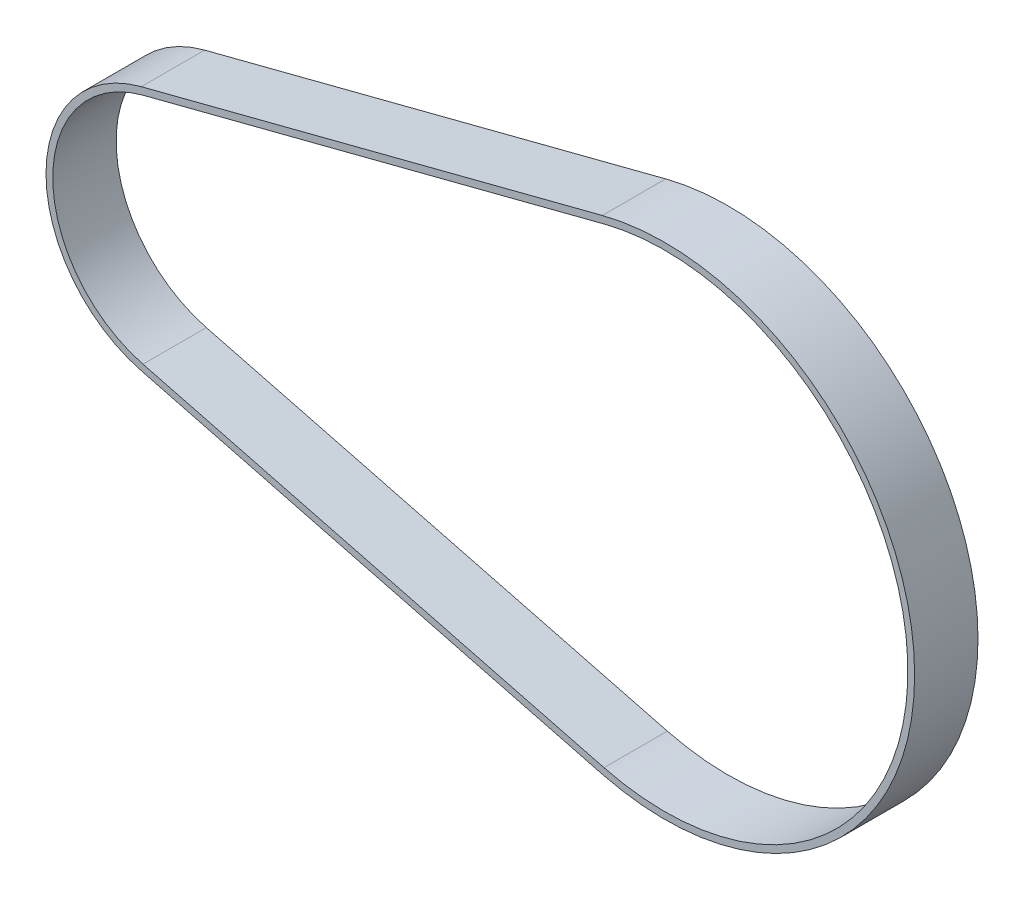
ISO-10303-21;
HEADER;
FILE_DESCRIPTION(('STEP AP214'),'2;1');
FILE_NAME('part.step','',(''),(''),'','','');
FILE_SCHEMA(('AUTOMOTIVE_DESIGN { 1 0 10303 214 1 1 1 1 }'));
ENDSEC;
DATA;
#1=APPLICATION_CONTEXT('core data for automotive mechanical design processes');
#2=APPLICATION_PROTOCOL_DEFINITION('international standard','automotive_design',2000,#1);
#3=PRODUCT_CONTEXT('',#1,'mechanical');
#4=PRODUCT('Part','Part','',(#3));
#5=PRODUCT_RELATED_PRODUCT_CATEGORY('part','',(#4));
#6=PRODUCT_DEFINITION_FORMATION('','',#4);
#7=PRODUCT_DEFINITION_CONTEXT('part definition',#1,'design');
#8=PRODUCT_DEFINITION('design','',#6,#7);
#9=PRODUCT_DEFINITION_SHAPE('','',#8);
#10=(LENGTH_UNIT() NAMED_UNIT(*) SI_UNIT(.MILLI.,.METRE.));
#11=(NAMED_UNIT(*) PLANE_ANGLE_UNIT() SI_UNIT($,.RADIAN.));
#12=(NAMED_UNIT(*) SI_UNIT($,.STERADIAN.) SOLID_ANGLE_UNIT());
#13=UNCERTAINTY_MEASURE_WITH_UNIT(LENGTH_MEASURE(1.E-05),#10,'distance_accuracy_value','');
#14=(GEOMETRIC_REPRESENTATION_CONTEXT(3) GLOBAL_UNCERTAINTY_ASSIGNED_CONTEXT((#13)) GLOBAL_UNIT_ASSIGNED_CONTEXT((#10,
#11,#12)) REPRESENTATION_CONTEXT('',''));
#15=CARTESIAN_POINT('',(0.,0.,0.));
#16=DIRECTION('',(0.,0.,1.));
#17=DIRECTION('',(1.,0.,0.));
#18=AXIS2_PLACEMENT_3D('',#15,#16,#17);
#19=CARTESIAN_POINT('',(-46.5636637389203,0.,3.));
#20=DIRECTION('',(0.,0.,1.));
#21=DIRECTION('',(1.,0.,0.));
#22=AXIS2_PLACEMENT_3D('',#19,#20,#21);
#23=PLANE('',#22);
#24=CARTESIAN_POINT('',(-46.5636637389203,0.,3.));
#25=DIRECTION('',(0.,0.,1.));
#26=DIRECTION('',(1.,0.,0.));
#27=AXIS2_PLACEMENT_3D('',#24,#25,#26);
#28=CIRCLE('',#27,12.03);
#29=CARTESIAN_POINT('',(-49.5696353219297,11.6483919423301,3.));
#30=VERTEX_POINT('',#29);
#31=CARTESIAN_POINT('',(-49.5696353219297,-11.6483919423301,3.));
#32=VERTEX_POINT('',#31);
#33=EDGE_CURVE('E134',#30,#32,#28,.T.);
#34=ORIENTED_EDGE('',*,*,#33,.T.);
#35=DIRECTION('',(0.968278631947636,-0.249872949543592,0.));
#36=VECTOR('',#35,1.);
#37=CARTESIAN_POINT('',(-49.5696353219297,-11.6483919423301,3.));
#38=LINE('',#37,#36);
#39=CARTESIAN_POINT('',(-5.91324335094905,-22.9143138250408,3.));
#40=VERTEX_POINT('',#39);
#41=EDGE_CURVE('E137',#32,#40,#38,.T.);
#42=ORIENTED_EDGE('',*,*,#41,.T.);
#43=CARTESIAN_POINT('',(0.,0.,3.));
#44=DIRECTION('',(0.,0.,1.));
#45=DIRECTION('',(1.,0.,0.));
#46=AXIS2_PLACEMENT_3D('',#43,#44,#45);
#47=CIRCLE('',#46,23.665);
#48=CARTESIAN_POINT('',(-5.91324335094903,22.9143138250408,3.));
#49=VERTEX_POINT('',#48);
#50=EDGE_CURVE('E140',#40,#49,#47,.T.);
#51=ORIENTED_EDGE('',*,*,#50,.T.);
#52=DIRECTION('',(-0.968278631947636,-0.249872949543592,0.));
#53=VECTOR('',#52,1.);
#54=CARTESIAN_POINT('',(-49.5696353219297,11.6483919423301,3.));
#55=LINE('',#54,#53);
#56=EDGE_CURVE('E142',#49,#30,#55,.T.);
#57=ORIENTED_EDGE('',*,*,#56,.T.);
#58=EDGE_LOOP('',(#34,#42,#51,#57));
#59=FACE_BOUND('',#58,.T.);
#60=DIRECTION('',(0.968278631947636,-0.249872949543592,0.));
#61=VECTOR('',#60,1.);
#62=CARTESIAN_POINT('',(-49.4097166342218,-11.0286936178836,3.));
#63=LINE('',#62,#61);
#64=CARTESIAN_POINT('',(-49.4097166342218,-11.0286936178836,3.));
#65=VERTEX_POINT('',#64);
#66=CARTESIAN_POINT('',(-5.75332466324115,-22.2946155005943,3.));
#67=VERTEX_POINT('',#66);
#68=EDGE_CURVE('E106',#65,#67,#63,.T.);
#69=ORIENTED_EDGE('',*,*,#68,.F.);
#70=CARTESIAN_POINT('',(-46.5636637389203,0.,3.));
#71=DIRECTION('',(0.,0.,1.));
#72=DIRECTION('',(1.,0.,0.));
#73=AXIS2_PLACEMENT_3D('',#70,#71,#72);
#74=CIRCLE('',#73,11.39);
#75=CARTESIAN_POINT('',(-49.4097166342218,11.0286936178836,3.));
#76=VERTEX_POINT('',#75);
#77=EDGE_CURVE('E98',#76,#65,#74,.T.);
#78=ORIENTED_EDGE('',*,*,#77,.F.);
#79=DIRECTION('',(-0.968278631947636,-0.249872949543592,0.));
#80=VECTOR('',#79,1.);
#81=CARTESIAN_POINT('',(-49.4097166342218,11.0286936178836,3.));
#82=LINE('',#81,#80);
#83=CARTESIAN_POINT('',(-5.75332466324115,22.2946155005943,3.));
#84=VERTEX_POINT('',#83);
#85=EDGE_CURVE('E120',#84,#76,#82,.T.);
#86=ORIENTED_EDGE('',*,*,#85,.F.);
#87=CARTESIAN_POINT('',(0.,0.,3.));
#88=DIRECTION('',(0.,0.,1.));
#89=DIRECTION('',(1.,0.,0.));
#90=AXIS2_PLACEMENT_3D('',#87,#88,#89);
#91=CIRCLE('',#90,23.025);
#92=EDGE_CURVE('E118',#67,#84,#91,.T.);
#93=ORIENTED_EDGE('',*,*,#92,.F.);
#94=EDGE_LOOP('',(#69,#78,#86,#93));
#95=FACE_BOUND('',#94,.T.);
#96=ADVANCED_FACE('F33',(#59,#95),#23,.T.);
#97=CARTESIAN_POINT('',(-46.5636637389203,0.,-3.));
#98=DIRECTION('',(0.,0.,1.));
#99=DIRECTION('',(1.,0.,0.));
#100=AXIS2_PLACEMENT_3D('',#97,#98,#99);
#101=PLANE('',#100);
#102=CARTESIAN_POINT('',(-46.5636637389203,0.,-3.));
#103=DIRECTION('',(0.,0.,1.));
#104=DIRECTION('',(1.,0.,0.));
#105=AXIS2_PLACEMENT_3D('',#102,#103,#104);
#106=CIRCLE('',#105,12.03);
#107=CARTESIAN_POINT('',(-49.5696353219297,11.6483919423301,-3.));
#108=VERTEX_POINT('',#107);
#109=CARTESIAN_POINT('',(-49.5696353219297,-11.6483919423301,-3.));
#110=VERTEX_POINT('',#109);
#111=EDGE_CURVE('E114',#108,#110,#106,.T.);
#112=ORIENTED_EDGE('',*,*,#111,.F.);
#113=DIRECTION('',(-0.968278631947636,-0.249872949543592,0.));
#114=VECTOR('',#113,1.);
#115=CARTESIAN_POINT('',(-49.5696353219297,11.6483919423301,-3.));
#116=LINE('',#115,#114);
#117=CARTESIAN_POINT('',(-5.91324335094903,22.9143138250408,-3.));
#118=VERTEX_POINT('',#117);
#119=EDGE_CURVE('E138',#118,#108,#116,.T.);
#120=ORIENTED_EDGE('',*,*,#119,.F.);
#121=CARTESIAN_POINT('',(0.,0.,-3.));
#122=DIRECTION('',(0.,0.,1.));
#123=DIRECTION('',(1.,0.,0.));
#124=AXIS2_PLACEMENT_3D('',#121,#122,#123);
#125=CIRCLE('',#124,23.665);
#126=CARTESIAN_POINT('',(-5.91324335094905,-22.9143138250408,-3.));
#127=VERTEX_POINT('',#126);
#128=EDGE_CURVE('E149',#127,#118,#125,.T.);
#129=ORIENTED_EDGE('',*,*,#128,.F.);
#130=DIRECTION('',(0.968278631947636,-0.249872949543592,0.));
#131=VECTOR('',#130,1.);
#132=CARTESIAN_POINT('',(-49.5696353219297,-11.6483919423301,-3.));
#133=LINE('',#132,#131);
#134=EDGE_CURVE('E147',#110,#127,#133,.T.);
#135=ORIENTED_EDGE('',*,*,#134,.F.);
#136=EDGE_LOOP('',(#112,#120,#129,#135));
#137=FACE_BOUND('',#136,.T.);
#138=CARTESIAN_POINT('',(-46.5636637389203,0.,-3.));
#139=DIRECTION('',(0.,0.,1.));
#140=DIRECTION('',(1.,0.,0.));
#141=AXIS2_PLACEMENT_3D('',#138,#139,#140);
#142=CIRCLE('',#141,11.39);
#143=CARTESIAN_POINT('',(-49.4097166342218,11.0286936178836,-3.));
#144=VERTEX_POINT('',#143);
#145=CARTESIAN_POINT('',(-49.4097166342218,-11.0286936178836,-3.));
#146=VERTEX_POINT('',#145);
#147=EDGE_CURVE('E56',#144,#146,#142,.T.);
#148=ORIENTED_EDGE('',*,*,#147,.T.);
#149=DIRECTION('',(0.968278631947636,-0.249872949543592,0.));
#150=VECTOR('',#149,1.);
#151=CARTESIAN_POINT('',(-49.4097166342218,-11.0286936178836,-3.));
#152=LINE('',#151,#150);
#153=CARTESIAN_POINT('',(-5.75332466324115,-22.2946155005943,-3.));
#154=VERTEX_POINT('',#153);
#155=EDGE_CURVE('E113',#146,#154,#152,.T.);
#156=ORIENTED_EDGE('',*,*,#155,.T.);
#157=CARTESIAN_POINT('',(0.,0.,-3.));
#158=DIRECTION('',(0.,0.,1.));
#159=DIRECTION('',(1.,0.,0.));
#160=AXIS2_PLACEMENT_3D('',#157,#158,#159);
#161=CIRCLE('',#160,23.025);
#162=CARTESIAN_POINT('',(-5.75332466324114,22.2946155005943,-3.));
#163=VERTEX_POINT('',#162);
#164=EDGE_CURVE('E126',#154,#163,#161,.T.);
#165=ORIENTED_EDGE('',*,*,#164,.T.);
#166=DIRECTION('',(-0.968278631947636,-0.249872949543592,0.));
#167=VECTOR('',#166,1.);
#168=CARTESIAN_POINT('',(-49.4097166342218,11.0286936178836,-3.));
#169=LINE('',#168,#167);
#170=EDGE_CURVE('E107',#163,#144,#169,.T.);
#171=ORIENTED_EDGE('',*,*,#170,.T.);
#172=EDGE_LOOP('',(#148,#156,#165,#171));
#173=FACE_BOUND('',#172,.T.);
#174=ADVANCED_FACE('F167',(#137,#173),#101,.F.);
#175=CARTESIAN_POINT('',(-46.5636637389203,0.,3.));
#176=DIRECTION('',(0.,0.,-1.));
#177=DIRECTION('',(-1.,0.,0.));
#178=AXIS2_PLACEMENT_3D('',#175,#176,#177);
#179=CYLINDRICAL_SURFACE('',#178,12.03);
#180=ORIENTED_EDGE('',*,*,#111,.T.);
#181=DIRECTION('',(0.,0.,-1.));
#182=VECTOR('',#181,1.);
#183=CARTESIAN_POINT('',(-49.5696353219297,-11.6483919423301,3.));
#184=LINE('',#183,#182);
#185=EDGE_CURVE('E11',#32,#110,#184,.T.);
#186=ORIENTED_EDGE('',*,*,#185,.F.);
#187=ORIENTED_EDGE('',*,*,#33,.F.);
#188=DIRECTION('',(0.,0.,-1.));
#189=VECTOR('',#188,1.);
#190=CARTESIAN_POINT('',(-49.5696353219297,11.6483919423301,3.));
#191=LINE('',#190,#189);
#192=EDGE_CURVE('E144',#30,#108,#191,.T.);
#193=ORIENTED_EDGE('',*,*,#192,.T.);
#194=EDGE_LOOP('',(#180,#186,#187,#193));
#195=FACE_BOUND('',#194,.T.);
#196=ADVANCED_FACE('F35',(#195),#179,.T.);
#197=CARTESIAN_POINT('',(-49.5696353219297,-11.6483919423301,3.));
#198=DIRECTION('',(0.249872949543592,0.968278631947636,0.));
#199=DIRECTION('',(-0.968278631947636,0.249872949543592,0.));
#200=AXIS2_PLACEMENT_3D('',#197,#198,#199);
#201=PLANE('',#200);
#202=ORIENTED_EDGE('',*,*,#134,.T.);
#203=DIRECTION('',(0.,0.,-1.));
#204=VECTOR('',#203,1.);
#205=CARTESIAN_POINT('',(-5.91324335094905,-22.9143138250408,3.));
#206=LINE('',#205,#204);
#207=EDGE_CURVE('E41',#40,#127,#206,.T.);
#208=ORIENTED_EDGE('',*,*,#207,.F.);
#209=ORIENTED_EDGE('',*,*,#41,.F.);
#210=ORIENTED_EDGE('',*,*,#185,.T.);
#211=EDGE_LOOP('',(#202,#208,#209,#210));
#212=FACE_BOUND('',#211,.T.);
#213=ADVANCED_FACE('F177',(#212),#201,.F.);
#214=CARTESIAN_POINT('',(0.,0.,3.));
#215=DIRECTION('',(0.,0.,-1.));
#216=DIRECTION('',(-1.,0.,0.));
#217=AXIS2_PLACEMENT_3D('',#214,#215,#216);
#218=CYLINDRICAL_SURFACE('',#217,23.665);
#219=ORIENTED_EDGE('',*,*,#128,.T.);
#220=DIRECTION('',(0.,0.,-1.));
#221=VECTOR('',#220,1.);
#222=CARTESIAN_POINT('',(-5.91324335094903,22.9143138250408,3.));
#223=LINE('',#222,#221);
#224=EDGE_CURVE('E154',#49,#118,#223,.T.);
#225=ORIENTED_EDGE('',*,*,#224,.F.);
#226=ORIENTED_EDGE('',*,*,#50,.F.);
#227=ORIENTED_EDGE('',*,*,#207,.T.);
#228=EDGE_LOOP('',(#219,#225,#226,#227));
#229=FACE_BOUND('',#228,.T.);
#230=ADVANCED_FACE('F161',(#229),#218,.T.);
#231=CARTESIAN_POINT('',(-49.5696353219297,11.6483919423301,3.));
#232=DIRECTION('',(0.249872949543592,-0.968278631947636,0.));
#233=DIRECTION('',(0.968278631947636,0.249872949543592,0.));
#234=AXIS2_PLACEMENT_3D('',#231,#232,#233);
#235=PLANE('',#234);
#236=ORIENTED_EDGE('',*,*,#119,.T.);
#237=ORIENTED_EDGE('',*,*,#192,.F.);
#238=ORIENTED_EDGE('',*,*,#56,.F.);
#239=ORIENTED_EDGE('',*,*,#224,.T.);
#240=EDGE_LOOP('',(#236,#237,#238,#239));
#241=FACE_BOUND('',#240,.T.);
#242=ADVANCED_FACE('F171',(#241),#235,.F.);
#243=CARTESIAN_POINT('',(-46.5636637389203,0.,3.));
#244=DIRECTION('',(0.,0.,-1.));
#245=DIRECTION('',(-1.,0.,0.));
#246=AXIS2_PLACEMENT_3D('',#243,#244,#245);
#247=CYLINDRICAL_SURFACE('',#246,11.39);
#248=ORIENTED_EDGE('',*,*,#147,.F.);
#249=DIRECTION('',(0.,0.,-1.));
#250=VECTOR('',#249,1.);
#251=CARTESIAN_POINT('',(-49.4097166342218,11.0286936178836,3.));
#252=LINE('',#251,#250);
#253=EDGE_CURVE('E102',#76,#144,#252,.T.);
#254=ORIENTED_EDGE('',*,*,#253,.F.);
#255=ORIENTED_EDGE('',*,*,#77,.T.);
#256=DIRECTION('',(0.,0.,-1.));
#257=VECTOR('',#256,1.);
#258=CARTESIAN_POINT('',(-49.4097166342218,-11.0286936178836,3.));
#259=LINE('',#258,#257);
#260=EDGE_CURVE('E101',#65,#146,#259,.T.);
#261=ORIENTED_EDGE('',*,*,#260,.T.);
#262=EDGE_LOOP('',(#248,#254,#255,#261));
#263=FACE_BOUND('',#262,.T.);
#264=ADVANCED_FACE('F100',(#263),#247,.F.);
#265=CARTESIAN_POINT('',(-49.4097166342218,-11.0286936178836,3.));
#266=DIRECTION('',(0.249872949543592,0.968278631947636,0.));
#267=DIRECTION('',(-0.968278631947636,0.249872949543592,0.));
#268=AXIS2_PLACEMENT_3D('',#265,#266,#267);
#269=PLANE('',#268);
#270=ORIENTED_EDGE('',*,*,#155,.F.);
#271=ORIENTED_EDGE('',*,*,#260,.F.);
#272=ORIENTED_EDGE('',*,*,#68,.T.);
#273=DIRECTION('',(0.,0.,-1.));
#274=VECTOR('',#273,1.);
#275=CARTESIAN_POINT('',(-5.75332466324115,-22.2946155005943,3.));
#276=LINE('',#275,#274);
#277=EDGE_CURVE('E115',#67,#154,#276,.T.);
#278=ORIENTED_EDGE('',*,*,#277,.T.);
#279=EDGE_LOOP('',(#270,#271,#272,#278));
#280=FACE_BOUND('',#279,.T.);
#281=ADVANCED_FACE('F110',(#280),#269,.T.);
#282=CARTESIAN_POINT('',(0.,0.,3.));
#283=DIRECTION('',(0.,0.,-1.));
#284=DIRECTION('',(-1.,0.,0.));
#285=AXIS2_PLACEMENT_3D('',#282,#283,#284);
#286=CYLINDRICAL_SURFACE('',#285,23.025);
#287=ORIENTED_EDGE('',*,*,#164,.F.);
#288=ORIENTED_EDGE('',*,*,#277,.F.);
#289=ORIENTED_EDGE('',*,*,#92,.T.);
#290=DIRECTION('',(0.,0.,-1.));
#291=VECTOR('',#290,1.);
#292=CARTESIAN_POINT('',(-5.75332466324114,22.2946155005943,3.));
#293=LINE('',#292,#291);
#294=EDGE_CURVE('E48',#84,#163,#293,.T.);
#295=ORIENTED_EDGE('',*,*,#294,.T.);
#296=EDGE_LOOP('',(#287,#288,#289,#295));
#297=FACE_BOUND('',#296,.T.);
#298=ADVANCED_FACE('F200',(#297),#286,.F.);
#299=CARTESIAN_POINT('',(-49.4097166342218,11.0286936178836,3.));
#300=DIRECTION('',(0.249872949543592,-0.968278631947636,0.));
#301=DIRECTION('',(0.968278631947636,0.249872949543592,0.));
#302=AXIS2_PLACEMENT_3D('',#299,#300,#301);
#303=PLANE('',#302);
#304=ORIENTED_EDGE('',*,*,#170,.F.);
#305=ORIENTED_EDGE('',*,*,#294,.F.);
#306=ORIENTED_EDGE('',*,*,#85,.T.);
#307=ORIENTED_EDGE('',*,*,#253,.T.);
#308=EDGE_LOOP('',(#304,#305,#306,#307));
#309=FACE_BOUND('',#308,.T.);
#310=ADVANCED_FACE('F204',(#309),#303,.T.);
#311=CLOSED_SHELL('',(#96,#174,#196,#213,#230,#242,#264,#281,#298,#310));
#312=MANIFOLD_SOLID_BREP('B2',#311);
#313=ADVANCED_BREP_SHAPE_REPRESENTATION('',(#18,#312),#14);
#314=SHAPE_DEFINITION_REPRESENTATION(#9,#313);
ENDSEC;
END-ISO-10303-21;
